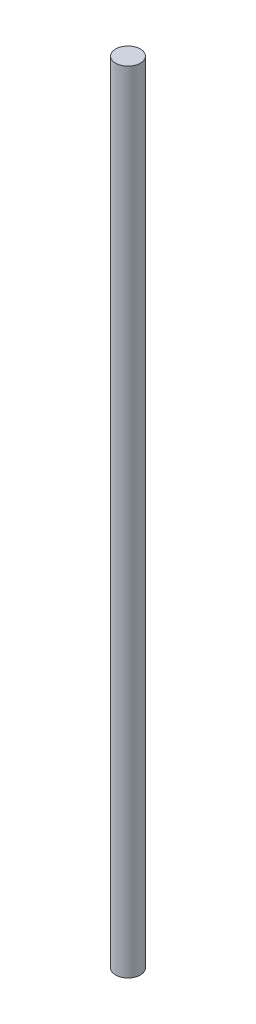
ISO-10303-21;
HEADER;
FILE_DESCRIPTION(('STEP AP214'),'2;1');
FILE_NAME('part.step','',(''),(''),'','','');
FILE_SCHEMA(('AUTOMOTIVE_DESIGN { 1 0 10303 214 1 1 1 1 }'));
ENDSEC;
DATA;
#1=APPLICATION_CONTEXT('core data for automotive mechanical design processes');
#2=APPLICATION_PROTOCOL_DEFINITION('international standard','automotive_design',2000,#1);
#3=PRODUCT_CONTEXT('',#1,'mechanical');
#4=PRODUCT('Part','Part','',(#3));
#5=PRODUCT_RELATED_PRODUCT_CATEGORY('part','',(#4));
#6=PRODUCT_DEFINITION_FORMATION('','',#4);
#7=PRODUCT_DEFINITION_CONTEXT('part definition',#1,'design');
#8=PRODUCT_DEFINITION('design','',#6,#7);
#9=PRODUCT_DEFINITION_SHAPE('','',#8);
#10=(LENGTH_UNIT() NAMED_UNIT(*) SI_UNIT(.MILLI.,.METRE.));
#11=(NAMED_UNIT(*) PLANE_ANGLE_UNIT() SI_UNIT($,.RADIAN.));
#12=(NAMED_UNIT(*) SI_UNIT($,.STERADIAN.) SOLID_ANGLE_UNIT());
#13=UNCERTAINTY_MEASURE_WITH_UNIT(LENGTH_MEASURE(1.E-05),#10,'distance_accuracy_value','');
#14=(GEOMETRIC_REPRESENTATION_CONTEXT(3) GLOBAL_UNCERTAINTY_ASSIGNED_CONTEXT((#13)) GLOBAL_UNIT_ASSIGNED_CONTEXT((#10,
#11,#12)) REPRESENTATION_CONTEXT('',''));
#15=CARTESIAN_POINT('',(0.,0.,0.));
#16=DIRECTION('',(0.,0.,1.));
#17=DIRECTION('',(1.,0.,0.));
#18=AXIS2_PLACEMENT_3D('',#15,#16,#17);
#19=CARTESIAN_POINT('',(0.,101.6,0.));
#20=DIRECTION('',(0.,-1.,0.));
#21=DIRECTION('',(0.,0.,-1.));
#22=AXIS2_PLACEMENT_3D('',#19,#20,#21);
#23=CYLINDRICAL_SURFACE('',#22,1.5875);
#24=CARTESIAN_POINT('',(0.,101.6,0.));
#25=DIRECTION('',(0.,1.,0.));
#26=DIRECTION('',(0.,0.,1.));
#27=AXIS2_PLACEMENT_3D('',#24,#25,#26);
#28=CIRCLE('',#27,1.5875);
#29=CARTESIAN_POINT('',(0.,101.6,1.5875));
#30=VERTEX_POINT('',#29);
#31=EDGE_CURVE('E10',#30,#30,#28,.T.);
#32=ORIENTED_EDGE('',*,*,#31,.F.);
#33=EDGE_LOOP('',(#32));
#34=FACE_BOUND('',#33,.T.);
#35=CARTESIAN_POINT('',(0.,0.,0.));
#36=DIRECTION('',(0.,1.,0.));
#37=DIRECTION('',(0.,0.,1.));
#38=AXIS2_PLACEMENT_3D('',#35,#36,#37);
#39=CIRCLE('',#38,1.5875);
#40=CARTESIAN_POINT('',(0.,0.,1.5875));
#41=VERTEX_POINT('',#40);
#42=EDGE_CURVE('E31',#41,#41,#39,.T.);
#43=ORIENTED_EDGE('',*,*,#42,.T.);
#44=EDGE_LOOP('',(#43));
#45=FACE_BOUND('',#44,.T.);
#46=ADVANCED_FACE('F28',(#34,#45),#23,.T.);
#47=CARTESIAN_POINT('',(0.,101.6,0.));
#48=DIRECTION('',(0.,1.,0.));
#49=DIRECTION('',(0.,0.,1.));
#50=AXIS2_PLACEMENT_3D('',#47,#48,#49);
#51=PLANE('',#50);
#52=ORIENTED_EDGE('',*,*,#31,.T.);
#53=EDGE_LOOP('',(#52));
#54=FACE_BOUND('',#53,.T.);
#55=ADVANCED_FACE('F43',(#54),#51,.T.);
#56=CARTESIAN_POINT('',(0.,0.,0.));
#57=DIRECTION('',(0.,1.,0.));
#58=DIRECTION('',(0.,0.,1.));
#59=AXIS2_PLACEMENT_3D('',#56,#57,#58);
#60=PLANE('',#59);
#61=ORIENTED_EDGE('',*,*,#42,.F.);
#62=EDGE_LOOP('',(#61));
#63=FACE_BOUND('',#62,.T.);
#64=ADVANCED_FACE('F41',(#63),#60,.F.);
#65=CLOSED_SHELL('',(#46,#55,#64));
#66=MANIFOLD_SOLID_BREP('B2',#65);
#67=ADVANCED_BREP_SHAPE_REPRESENTATION('',(#18,#66),#14);
#68=SHAPE_DEFINITION_REPRESENTATION(#9,#67);
ENDSEC;
END-ISO-10303-21;
